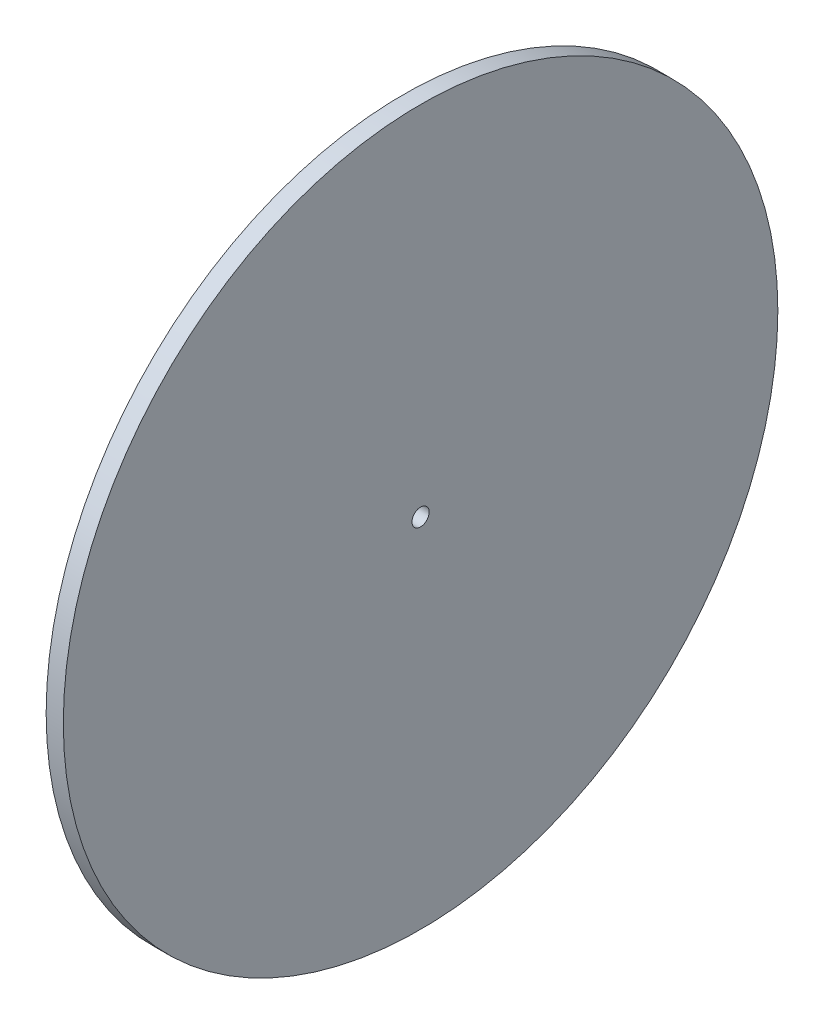
ISO-10303-21;
HEADER;
FILE_DESCRIPTION(('STEP AP214'),'2;1');
FILE_NAME('part.step','',(''),(''),'','','');
FILE_SCHEMA(('AUTOMOTIVE_DESIGN { 1 0 10303 214 1 1 1 1 }'));
ENDSEC;
DATA;
#1=APPLICATION_CONTEXT('core data for automotive mechanical design processes');
#2=APPLICATION_PROTOCOL_DEFINITION('international standard','automotive_design',2000,#1);
#3=PRODUCT_CONTEXT('',#1,'mechanical');
#4=PRODUCT('Part','Part','',(#3));
#5=PRODUCT_RELATED_PRODUCT_CATEGORY('part','',(#4));
#6=PRODUCT_DEFINITION_FORMATION('','',#4);
#7=PRODUCT_DEFINITION_CONTEXT('part definition',#1,'design');
#8=PRODUCT_DEFINITION('design','',#6,#7);
#9=PRODUCT_DEFINITION_SHAPE('','',#8);
#10=(LENGTH_UNIT() NAMED_UNIT(*) SI_UNIT(.MILLI.,.METRE.));
#11=(NAMED_UNIT(*) PLANE_ANGLE_UNIT() SI_UNIT($,.RADIAN.));
#12=(NAMED_UNIT(*) SI_UNIT($,.STERADIAN.) SOLID_ANGLE_UNIT());
#13=UNCERTAINTY_MEASURE_WITH_UNIT(LENGTH_MEASURE(1.E-05),#10,'distance_accuracy_value','');
#14=(GEOMETRIC_REPRESENTATION_CONTEXT(3) GLOBAL_UNCERTAINTY_ASSIGNED_CONTEXT((#13)) GLOBAL_UNIT_ASSIGNED_CONTEXT((#10,
#11,#12)) REPRESENTATION_CONTEXT('',''));
#15=CARTESIAN_POINT('',(0.,0.,0.));
#16=DIRECTION('',(0.,0.,1.));
#17=DIRECTION('',(1.,0.,0.));
#18=AXIS2_PLACEMENT_3D('',#15,#16,#17);
#19=CARTESIAN_POINT('',(3.,0.,0.));
#20=DIRECTION('',(-1.,0.,0.));
#21=DIRECTION('',(0.,0.,1.));
#22=AXIS2_PLACEMENT_3D('',#19,#20,#21);
#23=CYLINDRICAL_SURFACE('',#22,62.5);
#24=CARTESIAN_POINT('',(3.,0.,0.));
#25=DIRECTION('',(1.,0.,0.));
#26=DIRECTION('',(0.,0.,-1.));
#27=AXIS2_PLACEMENT_3D('',#24,#25,#26);
#28=CIRCLE('',#27,62.5);
#29=CARTESIAN_POINT('',(3.,0.,-62.5));
#30=VERTEX_POINT('',#29);
#31=EDGE_CURVE('E10',#30,#30,#28,.T.);
#32=ORIENTED_EDGE('',*,*,#31,.F.);
#33=EDGE_LOOP('',(#32));
#34=FACE_BOUND('',#33,.T.);
#35=CARTESIAN_POINT('',(0.,0.,0.));
#36=DIRECTION('',(1.,0.,0.));
#37=DIRECTION('',(0.,0.,-1.));
#38=AXIS2_PLACEMENT_3D('',#35,#36,#37);
#39=CIRCLE('',#38,62.5);
#40=CARTESIAN_POINT('',(0.,0.,-62.5));
#41=VERTEX_POINT('',#40);
#42=EDGE_CURVE('E34',#41,#41,#39,.T.);
#43=ORIENTED_EDGE('',*,*,#42,.T.);
#44=EDGE_LOOP('',(#43));
#45=FACE_BOUND('',#44,.T.);
#46=ADVANCED_FACE('F31',(#34,#45),#23,.T.);
#47=CARTESIAN_POINT('',(3.,0.,0.));
#48=DIRECTION('',(1.,0.,0.));
#49=DIRECTION('',(0.,0.,-1.));
#50=AXIS2_PLACEMENT_3D('',#47,#48,#49);
#51=PLANE('',#50);
#52=CARTESIAN_POINT('',(3.,0.,0.));
#53=DIRECTION('',(-1.,0.,0.));
#54=DIRECTION('',(0.,0.,1.));
#55=AXIS2_PLACEMENT_3D('',#52,#53,#54);
#56=CIRCLE('',#55,1.5);
#57=CARTESIAN_POINT('',(3.,0.,1.5));
#58=VERTEX_POINT('',#57);
#59=EDGE_CURVE('E41',#58,#58,#56,.T.);
#60=ORIENTED_EDGE('',*,*,#59,.T.);
#61=EDGE_LOOP('',(#60));
#62=FACE_BOUND('',#61,.T.);
#63=ORIENTED_EDGE('',*,*,#31,.T.);
#64=EDGE_LOOP('',(#63));
#65=FACE_BOUND('',#64,.T.);
#66=ADVANCED_FACE('F49',(#62,#65),#51,.T.);
#67=CARTESIAN_POINT('',(0.,0.,0.));
#68=DIRECTION('',(1.,0.,0.));
#69=DIRECTION('',(0.,0.,-1.));
#70=AXIS2_PLACEMENT_3D('',#67,#68,#69);
#71=PLANE('',#70);
#72=CARTESIAN_POINT('',(0.,0.,0.));
#73=DIRECTION('',(-1.,0.,0.));
#74=DIRECTION('',(0.,0.,1.));
#75=AXIS2_PLACEMENT_3D('',#72,#73,#74);
#76=CIRCLE('',#75,1.5);
#77=CARTESIAN_POINT('',(0.,0.,1.5));
#78=VERTEX_POINT('',#77);
#79=EDGE_CURVE('E43',#78,#78,#76,.T.);
#80=ORIENTED_EDGE('',*,*,#79,.F.);
#81=EDGE_LOOP('',(#80));
#82=FACE_BOUND('',#81,.T.);
#83=ORIENTED_EDGE('',*,*,#42,.F.);
#84=EDGE_LOOP('',(#83));
#85=FACE_BOUND('',#84,.T.);
#86=ADVANCED_FACE('F54',(#82,#85),#71,.F.);
#87=CARTESIAN_POINT('',(3.,0.,0.));
#88=DIRECTION('',(-1.,0.,0.));
#89=DIRECTION('',(0.,0.,1.));
#90=AXIS2_PLACEMENT_3D('',#87,#88,#89);
#91=CYLINDRICAL_SURFACE('',#90,1.5);
#92=ORIENTED_EDGE('',*,*,#59,.F.);
#93=EDGE_LOOP('',(#92));
#94=FACE_BOUND('',#93,.T.);
#95=ORIENTED_EDGE('',*,*,#79,.T.);
#96=EDGE_LOOP('',(#95));
#97=FACE_BOUND('',#96,.T.);
#98=ADVANCED_FACE('F51',(#94,#97),#91,.F.);
#99=CLOSED_SHELL('',(#46,#66,#86,#98));
#100=MANIFOLD_SOLID_BREP('B2',#99);
#101=ADVANCED_BREP_SHAPE_REPRESENTATION('',(#18,#100),#14);
#102=SHAPE_DEFINITION_REPRESENTATION(#9,#101);
ENDSEC;
END-ISO-10303-21;
